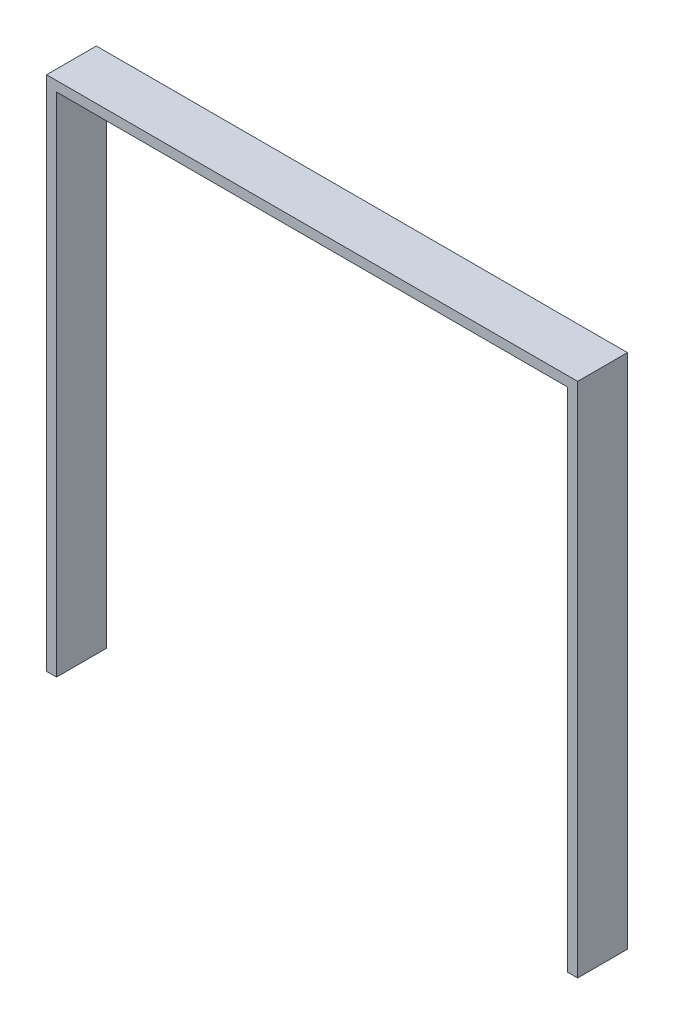
ISO-10303-21;
HEADER;
FILE_DESCRIPTION(('STEP AP214'),'2;1');
FILE_NAME('part.step','',(''),(''),'','','');
FILE_SCHEMA(('AUTOMOTIVE_DESIGN { 1 0 10303 214 1 1 1 1 }'));
ENDSEC;
DATA;
#1=APPLICATION_CONTEXT('core data for automotive mechanical design processes');
#2=APPLICATION_PROTOCOL_DEFINITION('international standard','automotive_design',2000,#1);
#3=PRODUCT_CONTEXT('',#1,'mechanical');
#4=PRODUCT('Part','Part','',(#3));
#5=PRODUCT_RELATED_PRODUCT_CATEGORY('part','',(#4));
#6=PRODUCT_DEFINITION_FORMATION('','',#4);
#7=PRODUCT_DEFINITION_CONTEXT('part definition',#1,'design');
#8=PRODUCT_DEFINITION('design','',#6,#7);
#9=PRODUCT_DEFINITION_SHAPE('','',#8);
#10=(LENGTH_UNIT() NAMED_UNIT(*) SI_UNIT(.MILLI.,.METRE.));
#11=(NAMED_UNIT(*) PLANE_ANGLE_UNIT() SI_UNIT($,.RADIAN.));
#12=(NAMED_UNIT(*) SI_UNIT($,.STERADIAN.) SOLID_ANGLE_UNIT());
#13=UNCERTAINTY_MEASURE_WITH_UNIT(LENGTH_MEASURE(1.E-05),#10,'distance_accuracy_value','');
#14=(GEOMETRIC_REPRESENTATION_CONTEXT(3) GLOBAL_UNCERTAINTY_ASSIGNED_CONTEXT((#13)) GLOBAL_UNIT_ASSIGNED_CONTEXT((#10,
#11,#12)) REPRESENTATION_CONTEXT('',''));
#15=CARTESIAN_POINT('',(0.,0.,0.));
#16=DIRECTION('',(0.,0.,1.));
#17=DIRECTION('',(1.,0.,0.));
#18=AXIS2_PLACEMENT_3D('',#15,#16,#17);
#19=CARTESIAN_POINT('',(0.,50.,0.));
#20=DIRECTION('',(0.,1.,0.));
#21=DIRECTION('',(0.,0.,1.));
#22=AXIS2_PLACEMENT_3D('',#19,#20,#21);
#23=PLANE('',#22);
#24=DIRECTION('',(0.,0.,-1.));
#25=VECTOR('',#24,1.);
#26=CARTESIAN_POINT('',(71.4081272452346,50.,7.));
#27=LINE('',#26,#25);
#28=CARTESIAN_POINT('',(71.4081272452346,50.,-12.));
#29=VERTEX_POINT('',#28);
#30=CARTESIAN_POINT('',(71.4081272452346,50.,-27.));
#31=VERTEX_POINT('',#30);
#32=EDGE_CURVE('E128',#29,#31,#27,.T.);
#33=ORIENTED_EDGE('',*,*,#32,.T.);
#34=DIRECTION('',(1.,0.,0.));
#35=VECTOR('',#34,1.);
#36=CARTESIAN_POINT('',(216.408127245235,50.,-27.));
#37=LINE('',#36,#35);
#38=CARTESIAN_POINT('',(74.4081272452346,50.,-27.));
#39=VERTEX_POINT('',#38);
#40=EDGE_CURVE('E121',#31,#39,#37,.T.);
#41=ORIENTED_EDGE('',*,*,#40,.T.);
#42=DIRECTION('',(0.,0.,1.));
#43=VECTOR('',#42,1.);
#44=CARTESIAN_POINT('',(74.4081272452346,50.,-12.));
#45=LINE('',#44,#43);
#46=CARTESIAN_POINT('',(74.4081272452346,50.,-12.));
#47=VERTEX_POINT('',#46);
#48=EDGE_CURVE('E47',#39,#47,#45,.T.);
#49=ORIENTED_EDGE('',*,*,#48,.T.);
#50=DIRECTION('',(1.,0.,0.));
#51=VECTOR('',#50,1.);
#52=CARTESIAN_POINT('',(216.408127245235,50.,-12.));
#53=LINE('',#52,#51);
#54=EDGE_CURVE('E150',#29,#47,#53,.T.);
#55=ORIENTED_EDGE('',*,*,#54,.F.);
#56=EDGE_LOOP('',(#33,#41,#49,#55));
#57=FACE_BOUND('',#56,.T.);
#58=ADVANCED_FACE('F43',(#57),#23,.F.);
#59=DIRECTION('',(0.,0.,-1.));
#60=VECTOR('',#59,1.);
#61=CARTESIAN_POINT('',(228.408127245235,50.,-12.));
#62=LINE('',#61,#60);
#63=CARTESIAN_POINT('',(228.408127245235,50.,-12.));
#64=VERTEX_POINT('',#63);
#65=CARTESIAN_POINT('',(228.408127245235,50.,-27.));
#66=VERTEX_POINT('',#65);
#67=EDGE_CURVE('E124',#64,#66,#62,.T.);
#68=ORIENTED_EDGE('',*,*,#67,.T.);
#69=CARTESIAN_POINT('',(231.408127245235,50.,-27.));
#70=VERTEX_POINT('',#69);
#71=EDGE_CURVE('E110',#66,#70,#37,.T.);
#72=ORIENTED_EDGE('',*,*,#71,.T.);
#73=DIRECTION('',(0.,0.,-1.));
#74=VECTOR('',#73,1.);
#75=CARTESIAN_POINT('',(231.408127245235,50.,7.));
#76=LINE('',#75,#74);
#77=CARTESIAN_POINT('',(231.408127245235,50.,-12.));
#78=VERTEX_POINT('',#77);
#79=EDGE_CURVE('E157',#78,#70,#76,.T.);
#80=ORIENTED_EDGE('',*,*,#79,.F.);
#81=EDGE_CURVE('E126',#64,#78,#53,.T.);
#82=ORIENTED_EDGE('',*,*,#81,.F.);
#83=EDGE_LOOP('',(#68,#72,#80,#82));
#84=FACE_BOUND('',#83,.T.);
#85=ADVANCED_FACE('F125',(#84),#23,.F.);
#86=CARTESIAN_POINT('',(216.408127245235,-39.3282289412094,-12.));
#87=DIRECTION('',(0.,0.,-1.));
#88=DIRECTION('',(-1.,0.,0.));
#89=AXIS2_PLACEMENT_3D('',#86,#87,#88);
#90=PLANE('',#89);
#91=DIRECTION('',(0.,-1.,0.));
#92=VECTOR('',#91,1.);
#93=CARTESIAN_POINT('',(71.4081272452346,205.671771058791,-12.));
#94=LINE('',#93,#92);
#95=CARTESIAN_POINT('',(71.4081272452346,205.671771058791,-12.));
#96=VERTEX_POINT('',#95);
#97=EDGE_CURVE('E11',#96,#29,#94,.T.);
#98=ORIENTED_EDGE('',*,*,#97,.T.);
#99=ORIENTED_EDGE('',*,*,#54,.T.);
#100=DIRECTION('',(0.,1.,0.));
#101=VECTOR('',#100,1.);
#102=CARTESIAN_POINT('',(74.4081272452347,-39.3282289412095,-12.));
#103=LINE('',#102,#101);
#104=CARTESIAN_POINT('',(74.4081272452346,202.671771058791,-12.));
#105=VERTEX_POINT('',#104);
#106=EDGE_CURVE('E144',#47,#105,#103,.T.);
#107=ORIENTED_EDGE('',*,*,#106,.T.);
#108=DIRECTION('',(1.,0.,0.));
#109=VECTOR('',#108,1.);
#110=CARTESIAN_POINT('',(216.408127245235,202.671771058791,-12.));
#111=LINE('',#110,#109);
#112=CARTESIAN_POINT('',(228.408127245235,202.671771058791,-12.));
#113=VERTEX_POINT('',#112);
#114=EDGE_CURVE('E66',#105,#113,#111,.T.);
#115=ORIENTED_EDGE('',*,*,#114,.T.);
#116=DIRECTION('',(0.,-1.,0.));
#117=VECTOR('',#116,1.);
#118=CARTESIAN_POINT('',(228.408127245235,190.671771058791,-12.));
#119=LINE('',#118,#117);
#120=EDGE_CURVE('E52',#113,#64,#119,.T.);
#121=ORIENTED_EDGE('',*,*,#120,.T.);
#122=ORIENTED_EDGE('',*,*,#81,.T.);
#123=DIRECTION('',(0.,-1.,0.));
#124=VECTOR('',#123,1.);
#125=CARTESIAN_POINT('',(231.408127245235,0.,-12.));
#126=LINE('',#125,#124);
#127=CARTESIAN_POINT('',(231.408127245235,205.671771058791,-12.));
#128=VERTEX_POINT('',#127);
#129=EDGE_CURVE('E136',#128,#78,#126,.T.);
#130=ORIENTED_EDGE('',*,*,#129,.F.);
#131=DIRECTION('',(-1.,0.,0.));
#132=VECTOR('',#131,1.);
#133=CARTESIAN_POINT('',(0.,205.671771058791,-12.));
#134=LINE('',#133,#132);
#135=EDGE_CURVE('E59',#128,#96,#134,.T.);
#136=ORIENTED_EDGE('',*,*,#135,.T.);
#137=EDGE_LOOP('',(#98,#99,#107,#115,#121,#122,#130,#136));
#138=FACE_BOUND('',#137,.T.);
#139=ADVANCED_FACE('F179',(#138),#90,.F.);
#140=CARTESIAN_POINT('',(74.4081272452347,-39.3282289412095,-12.));
#141=DIRECTION('',(1.,0.,0.));
#142=DIRECTION('',(0.,1.,0.));
#143=AXIS2_PLACEMENT_3D('',#140,#141,#142);
#144=PLANE('',#143);
#145=ORIENTED_EDGE('',*,*,#48,.F.);
#146=DIRECTION('',(0.,-1.,0.));
#147=VECTOR('',#146,1.);
#148=CARTESIAN_POINT('',(74.4081272452346,202.671771058791,-27.));
#149=LINE('',#148,#147);
#150=CARTESIAN_POINT('',(74.4081272452346,202.671771058791,-27.));
#151=VERTEX_POINT('',#150);
#152=EDGE_CURVE('E138',#151,#39,#149,.T.);
#153=ORIENTED_EDGE('',*,*,#152,.F.);
#154=DIRECTION('',(0.,0.,1.));
#155=VECTOR('',#154,1.);
#156=CARTESIAN_POINT('',(74.4081272452346,202.671771058791,-12.));
#157=LINE('',#156,#155);
#158=EDGE_CURVE('E166',#151,#105,#157,.T.);
#159=ORIENTED_EDGE('',*,*,#158,.T.);
#160=ORIENTED_EDGE('',*,*,#106,.F.);
#161=EDGE_LOOP('',(#145,#153,#159,#160));
#162=FACE_BOUND('',#161,.T.);
#163=ADVANCED_FACE('F184',(#162),#144,.T.);
#164=CARTESIAN_POINT('',(216.408127245235,202.671771058791,-12.));
#165=DIRECTION('',(0.,-1.,0.));
#166=DIRECTION('',(0.,0.,-1.));
#167=AXIS2_PLACEMENT_3D('',#164,#165,#166);
#168=PLANE('',#167);
#169=ORIENTED_EDGE('',*,*,#114,.F.);
#170=ORIENTED_EDGE('',*,*,#158,.F.);
#171=DIRECTION('',(-1.,0.,0.));
#172=VECTOR('',#171,1.);
#173=CARTESIAN_POINT('',(228.408127245235,202.671771058791,-27.));
#174=LINE('',#173,#172);
#175=CARTESIAN_POINT('',(228.408127245235,202.671771058791,-27.));
#176=VERTEX_POINT('',#175);
#177=EDGE_CURVE('E134',#176,#151,#174,.T.);
#178=ORIENTED_EDGE('',*,*,#177,.F.);
#179=DIRECTION('',(0.,0.,1.));
#180=VECTOR('',#179,1.);
#181=CARTESIAN_POINT('',(228.408127245235,202.671771058791,-12.));
#182=LINE('',#181,#180);
#183=EDGE_CURVE('E132',#176,#113,#182,.T.);
#184=ORIENTED_EDGE('',*,*,#183,.T.);
#185=EDGE_LOOP('',(#169,#170,#178,#184));
#186=FACE_BOUND('',#185,.T.);
#187=ADVANCED_FACE('F181',(#186),#168,.T.);
#188=CARTESIAN_POINT('',(228.408127245235,190.671771058791,-12.));
#189=DIRECTION('',(-1.,0.,0.));
#190=DIRECTION('',(0.,0.,1.));
#191=AXIS2_PLACEMENT_3D('',#188,#189,#190);
#192=PLANE('',#191);
#193=ORIENTED_EDGE('',*,*,#67,.F.);
#194=ORIENTED_EDGE('',*,*,#120,.F.);
#195=ORIENTED_EDGE('',*,*,#183,.F.);
#196=DIRECTION('',(0.,1.,0.));
#197=VECTOR('',#196,1.);
#198=CARTESIAN_POINT('',(228.408127245235,-39.3282289412094,-27.));
#199=LINE('',#198,#197);
#200=EDGE_CURVE('E114',#66,#176,#199,.T.);
#201=ORIENTED_EDGE('',*,*,#200,.F.);
#202=EDGE_LOOP('',(#193,#194,#195,#201));
#203=FACE_BOUND('',#202,.T.);
#204=ADVANCED_FACE('F130',(#203),#192,.T.);
#205=CARTESIAN_POINT('',(231.408127245235,0.,7.));
#206=DIRECTION('',(-1.,0.,0.));
#207=DIRECTION('',(0.,0.,1.));
#208=AXIS2_PLACEMENT_3D('',#205,#206,#207);
#209=PLANE('',#208);
#210=ORIENTED_EDGE('',*,*,#129,.T.);
#211=ORIENTED_EDGE('',*,*,#79,.T.);
#212=DIRECTION('',(0.,-1.,0.));
#213=VECTOR('',#212,1.);
#214=CARTESIAN_POINT('',(231.408127245235,-39.3282289412094,-27.));
#215=LINE('',#214,#213);
#216=CARTESIAN_POINT('',(231.408127245235,205.671771058791,-27.));
#217=VERTEX_POINT('',#216);
#218=EDGE_CURVE('E118',#217,#70,#215,.T.);
#219=ORIENTED_EDGE('',*,*,#218,.F.);
#220=DIRECTION('',(0.,0.,-1.));
#221=VECTOR('',#220,1.);
#222=CARTESIAN_POINT('',(231.408127245235,205.671771058791,7.));
#223=LINE('',#222,#221);
#224=EDGE_CURVE('E159',#128,#217,#223,.T.);
#225=ORIENTED_EDGE('',*,*,#224,.F.);
#226=EDGE_LOOP('',(#210,#211,#219,#225));
#227=FACE_BOUND('',#226,.T.);
#228=ADVANCED_FACE('F178',(#227),#209,.F.);
#229=CARTESIAN_POINT('',(0.,205.671771058791,7.));
#230=DIRECTION('',(0.,1.,0.));
#231=DIRECTION('',(-1.,0.,0.));
#232=AXIS2_PLACEMENT_3D('',#229,#230,#231);
#233=PLANE('',#232);
#234=ORIENTED_EDGE('',*,*,#135,.F.);
#235=ORIENTED_EDGE('',*,*,#224,.T.);
#236=DIRECTION('',(1.,0.,0.));
#237=VECTOR('',#236,1.);
#238=CARTESIAN_POINT('',(231.408127245235,205.671771058791,-27.));
#239=LINE('',#238,#237);
#240=CARTESIAN_POINT('',(71.4081272452346,205.671771058791,-27.));
#241=VERTEX_POINT('',#240);
#242=EDGE_CURVE('E148',#241,#217,#239,.T.);
#243=ORIENTED_EDGE('',*,*,#242,.F.);
#244=DIRECTION('',(0.,0.,1.));
#245=VECTOR('',#244,1.);
#246=CARTESIAN_POINT('',(71.4081272452347,205.671771058791,-12.));
#247=LINE('',#246,#245);
#248=EDGE_CURVE('E169',#241,#96,#247,.T.);
#249=ORIENTED_EDGE('',*,*,#248,.T.);
#250=EDGE_LOOP('',(#234,#235,#243,#249));
#251=FACE_BOUND('',#250,.T.);
#252=ADVANCED_FACE('F175',(#251),#233,.T.);
#253=CARTESIAN_POINT('',(71.4081272452346,0.,7.));
#254=DIRECTION('',(-1.,0.,0.));
#255=DIRECTION('',(0.,0.,1.));
#256=AXIS2_PLACEMENT_3D('',#253,#254,#255);
#257=PLANE('',#256);
#258=ORIENTED_EDGE('',*,*,#32,.F.);
#259=ORIENTED_EDGE('',*,*,#97,.F.);
#260=ORIENTED_EDGE('',*,*,#248,.F.);
#261=DIRECTION('',(0.,1.,0.));
#262=VECTOR('',#261,1.);
#263=CARTESIAN_POINT('',(71.4081272452346,205.671771058791,-27.));
#264=LINE('',#263,#262);
#265=EDGE_CURVE('E147',#31,#241,#264,.T.);
#266=ORIENTED_EDGE('',*,*,#265,.F.);
#267=EDGE_LOOP('',(#258,#259,#260,#266));
#268=FACE_BOUND('',#267,.T.);
#269=ADVANCED_FACE('F205',(#268),#257,.T.);
#270=CARTESIAN_POINT('',(216.408127245235,-39.3282289412094,-27.));
#271=DIRECTION('',(0.,0.,-1.));
#272=DIRECTION('',(-1.,0.,0.));
#273=AXIS2_PLACEMENT_3D('',#270,#271,#272);
#274=PLANE('',#273);
#275=ORIENTED_EDGE('',*,*,#40,.F.);
#276=ORIENTED_EDGE('',*,*,#265,.T.);
#277=ORIENTED_EDGE('',*,*,#242,.T.);
#278=ORIENTED_EDGE('',*,*,#218,.T.);
#279=ORIENTED_EDGE('',*,*,#71,.F.);
#280=ORIENTED_EDGE('',*,*,#200,.T.);
#281=ORIENTED_EDGE('',*,*,#177,.T.);
#282=ORIENTED_EDGE('',*,*,#152,.T.);
#283=EDGE_LOOP('',(#275,#276,#277,#278,#279,#280,#281,#282));
#284=FACE_BOUND('',#283,.T.);
#285=ADVANCED_FACE('F45',(#284),#274,.T.);
#286=CLOSED_SHELL('',(#58,#85,#139,#163,#187,#204,#228,#252,#269,#285));
#287=MANIFOLD_SOLID_BREP('B2',#286);
#288=ADVANCED_BREP_SHAPE_REPRESENTATION('',(#18,#287),#14);
#289=SHAPE_DEFINITION_REPRESENTATION(#9,#288);
ENDSEC;
END-ISO-10303-21;
